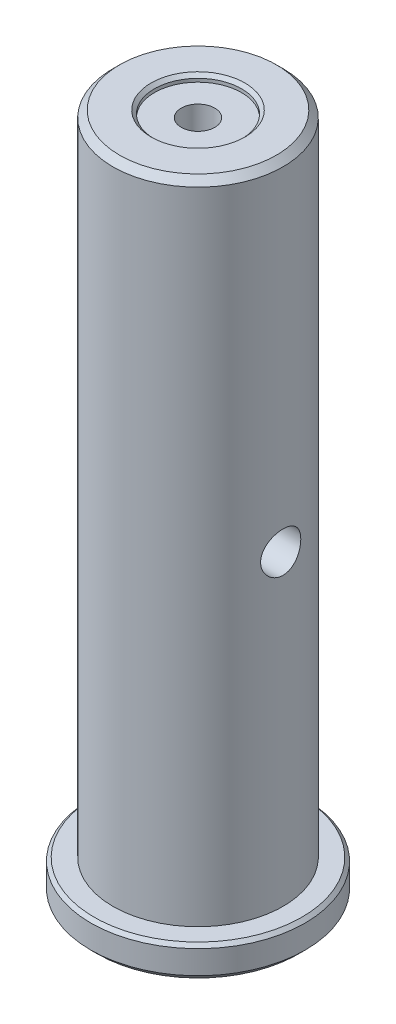
ISO-10303-21;
HEADER;
FILE_DESCRIPTION(('STEP AP214'),'2;1');
FILE_NAME('part.step','',(''),(''),'','','');
FILE_SCHEMA(('AUTOMOTIVE_DESIGN { 1 0 10303 214 1 1 1 1 }'));
ENDSEC;
DATA;
#1=APPLICATION_CONTEXT('core data for automotive mechanical design processes');
#2=APPLICATION_PROTOCOL_DEFINITION('international standard','automotive_design',2000,#1);
#3=PRODUCT_CONTEXT('',#1,'mechanical');
#4=PRODUCT('Part','Part','',(#3));
#5=PRODUCT_RELATED_PRODUCT_CATEGORY('part','',(#4));
#6=PRODUCT_DEFINITION_FORMATION('','',#4);
#7=PRODUCT_DEFINITION_CONTEXT('part definition',#1,'design');
#8=PRODUCT_DEFINITION('design','',#6,#7);
#9=PRODUCT_DEFINITION_SHAPE('','',#8);
#10=(LENGTH_UNIT() NAMED_UNIT(*) SI_UNIT(.MILLI.,.METRE.));
#11=(NAMED_UNIT(*) PLANE_ANGLE_UNIT() SI_UNIT($,.RADIAN.));
#12=(NAMED_UNIT(*) SI_UNIT($,.STERADIAN.) SOLID_ANGLE_UNIT());
#13=UNCERTAINTY_MEASURE_WITH_UNIT(LENGTH_MEASURE(1.E-05),#10,'distance_accuracy_value','');
#14=(GEOMETRIC_REPRESENTATION_CONTEXT(3) GLOBAL_UNCERTAINTY_ASSIGNED_CONTEXT((#13)) GLOBAL_UNIT_ASSIGNED_CONTEXT((#10,
#11,#12)) REPRESENTATION_CONTEXT('',''));
#15=CARTESIAN_POINT('',(0.,0.,0.));
#16=DIRECTION('',(0.,0.,1.));
#17=DIRECTION('',(1.,0.,0.));
#18=AXIS2_PLACEMENT_3D('',#15,#16,#17);
#19=CARTESIAN_POINT('',(0.,-26.0999999998717,0.));
#20=DIRECTION('',(0.,-1.,0.));
#21=DIRECTION('',(0.,0.,-1.));
#22=AXIS2_PLACEMENT_3D('',#19,#20,#21);
#23=CONICAL_SURFACE('',#22,2.49999999988404,1.02974425862171);
#24=CARTESIAN_POINT('',(0.,-24.5978484523448,5.6843418860808E-11));
#25=VERTEX_POINT('',#24);
#26=VERTEX_LOOP('',#25);
#27=FACE_BOUND('',#26,.T.);
#28=CARTESIAN_POINT('',(0.,-26.1,0.));
#29=DIRECTION('',(0.,-1.,0.));
#30=DIRECTION('',(0.,0.,-1.));
#31=AXIS2_PLACEMENT_3D('',#28,#29,#30);
#32=CIRCLE('',#31,2.5);
#33=CARTESIAN_POINT('',(0.,-26.1,-2.5));
#34=VERTEX_POINT('',#33);
#35=EDGE_CURVE('E70',#34,#34,#32,.T.);
#36=ORIENTED_EDGE('',*,*,#35,.T.);
#37=EDGE_LOOP('',(#36));
#38=FACE_BOUND('',#37,.T.);
#39=ADVANCED_FACE('F37',(#27,#38),#23,.F.);
#40=CARTESIAN_POINT('',(0.,-37.1,0.));
#41=DIRECTION('',(0.,-1.,0.));
#42=DIRECTION('',(0.,0.,-1.));
#43=AXIS2_PLACEMENT_3D('',#40,#41,#42);
#44=CYLINDRICAL_SURFACE('',#43,2.5);
#45=CARTESIAN_POINT('',(0.,-37.1,0.));
#46=DIRECTION('',(0.,-1.,0.));
#47=DIRECTION('',(0.,0.,-1.));
#48=AXIS2_PLACEMENT_3D('',#45,#46,#47);
#49=CIRCLE('',#48,2.5);
#50=CARTESIAN_POINT('',(0.,-37.1,-2.5));
#51=VERTEX_POINT('',#50);
#52=EDGE_CURVE('E96',#51,#51,#49,.T.);
#53=ORIENTED_EDGE('',*,*,#52,.T.);
#54=EDGE_LOOP('',(#53));
#55=FACE_BOUND('',#54,.T.);
#56=ORIENTED_EDGE('',*,*,#35,.F.);
#57=EDGE_LOOP('',(#56));
#58=FACE_BOUND('',#57,.T.);
#59=ADVANCED_FACE('F155',(#55,#58),#44,.F.);
#60=CARTESIAN_POINT('',(0.,-37.1,0.));
#61=DIRECTION('',(0.,1.,0.));
#62=DIRECTION('',(0.,0.,1.));
#63=AXIS2_PLACEMENT_3D('',#60,#61,#62);
#64=PLANE('',#63);
#65=CARTESIAN_POINT('',(0.,-37.1,0.));
#66=DIRECTION('',(0.,-1.,0.));
#67=DIRECTION('',(0.,0.,-1.));
#68=AXIS2_PLACEMENT_3D('',#65,#66,#67);
#69=CIRCLE('',#68,9.00000000000001);
#70=CARTESIAN_POINT('',(0.,-37.1,-9.00000000000001));
#71=VERTEX_POINT('',#70);
#72=EDGE_CURVE('E91',#71,#71,#69,.T.);
#73=ORIENTED_EDGE('',*,*,#72,.T.);
#74=EDGE_LOOP('',(#73));
#75=FACE_BOUND('',#74,.T.);
#76=ORIENTED_EDGE('',*,*,#52,.F.);
#77=EDGE_LOOP('',(#76));
#78=FACE_BOUND('',#77,.T.);
#79=ADVANCED_FACE('F162',(#75,#78),#64,.F.);
#80=CARTESIAN_POINT('',(0.,-37.6,0.));
#81=DIRECTION('',(0.,-1.,0.));
#82=DIRECTION('',(0.,0.,-1.));
#83=AXIS2_PLACEMENT_3D('',#80,#81,#82);
#84=CONICAL_SURFACE('',#83,9.50000000000001,0.78539816339745);
#85=ORIENTED_EDGE('',*,*,#72,.F.);
#86=EDGE_LOOP('',(#85));
#87=FACE_BOUND('',#86,.T.);
#88=CARTESIAN_POINT('',(0.,-37.6,0.));
#89=DIRECTION('',(0.,1.,0.));
#90=DIRECTION('',(0.,0.,1.));
#91=AXIS2_PLACEMENT_3D('',#88,#89,#90);
#92=CIRCLE('',#91,9.50000000000001);
#93=CARTESIAN_POINT('',(0.,-37.6,9.50000000000001));
#94=VERTEX_POINT('',#93);
#95=EDGE_CURVE('E87',#94,#94,#92,.F.);
#96=ORIENTED_EDGE('',*,*,#95,.T.);
#97=EDGE_LOOP('',(#96));
#98=FACE_BOUND('',#97,.T.);
#99=ADVANCED_FACE('F169',(#87,#98),#84,.F.);
#100=CARTESIAN_POINT('',(0.,26.5038387670979,0.));
#101=DIRECTION('',(0.,1.,0.));
#102=DIRECTION('',(0.,0.,1.));
#103=AXIS2_PLACEMENT_3D('',#100,#101,#102);
#104=CYLINDRICAL_SURFACE('',#103,9.50000000000001);
#105=ORIENTED_EDGE('',*,*,#95,.F.);
#106=EDGE_LOOP('',(#105));
#107=FACE_BOUND('',#106,.T.);
#108=CARTESIAN_POINT('',(0.,-38.1,0.));
#109=DIRECTION('',(0.,1.,0.));
#110=DIRECTION('',(0.,0.,1.));
#111=AXIS2_PLACEMENT_3D('',#108,#109,#110);
#112=CIRCLE('',#111,9.50000000000001);
#113=CARTESIAN_POINT('',(0.,-38.1,9.50000000000001));
#114=VERTEX_POINT('',#113);
#115=EDGE_CURVE('E90',#114,#114,#112,.F.);
#116=ORIENTED_EDGE('',*,*,#115,.T.);
#117=EDGE_LOOP('',(#116));
#118=FACE_BOUND('',#117,.T.);
#119=ADVANCED_FACE('F173',(#107,#118),#104,.F.);
#120=CARTESIAN_POINT('',(9.50000000000001,-38.1,0.));
#121=DIRECTION('',(0.,1.,0.));
#122=DIRECTION('',(0.,0.,1.));
#123=AXIS2_PLACEMENT_3D('',#120,#121,#122);
#124=PLANE('',#123);
#125=ORIENTED_EDGE('',*,*,#115,.F.);
#126=EDGE_LOOP('',(#125));
#127=FACE_BOUND('',#126,.T.);
#128=CARTESIAN_POINT('',(0.,-38.1,0.));
#129=DIRECTION('',(0.,1.,0.));
#130=DIRECTION('',(0.,0.,1.));
#131=AXIS2_PLACEMENT_3D('',#128,#129,#130);
#132=CIRCLE('',#131,15.);
#133=CARTESIAN_POINT('',(0.,-38.1,15.));
#134=VERTEX_POINT('',#133);
#135=EDGE_CURVE('E84',#134,#134,#132,.T.);
#136=ORIENTED_EDGE('',*,*,#135,.F.);
#137=EDGE_LOOP('',(#136));
#138=FACE_BOUND('',#137,.T.);
#139=ADVANCED_FACE('F176',(#127,#138),#124,.F.);
#140=CARTESIAN_POINT('',(0.,-37.1,0.));
#141=DIRECTION('',(0.,1.,0.));
#142=DIRECTION('',(0.,0.,1.));
#143=AXIS2_PLACEMENT_3D('',#140,#141,#142);
#144=CONICAL_SURFACE('',#143,16.,0.785398163397447);
#145=ORIENTED_EDGE('',*,*,#135,.T.);
#146=EDGE_LOOP('',(#145));
#147=FACE_BOUND('',#146,.T.);
#148=CARTESIAN_POINT('',(0.,-37.1,0.));
#149=DIRECTION('',(0.,1.,0.));
#150=DIRECTION('',(0.,0.,1.));
#151=AXIS2_PLACEMENT_3D('',#148,#149,#150);
#152=CIRCLE('',#151,16.);
#153=CARTESIAN_POINT('',(0.,-37.1,16.));
#154=VERTEX_POINT('',#153);
#155=EDGE_CURVE('E79',#154,#154,#152,.T.);
#156=ORIENTED_EDGE('',*,*,#155,.F.);
#157=EDGE_LOOP('',(#156));
#158=FACE_BOUND('',#157,.T.);
#159=ADVANCED_FACE('F180',(#147,#158),#144,.T.);
#160=CARTESIAN_POINT('',(0.,26.5038387670979,0.));
#161=DIRECTION('',(0.,1.,0.));
#162=DIRECTION('',(0.,0.,1.));
#163=AXIS2_PLACEMENT_3D('',#160,#161,#162);
#164=CYLINDRICAL_SURFACE('',#163,16.);
#165=ORIENTED_EDGE('',*,*,#155,.T.);
#166=EDGE_LOOP('',(#165));
#167=FACE_BOUND('',#166,.T.);
#168=CARTESIAN_POINT('',(0.,-33.6,0.));
#169=DIRECTION('',(0.,-1.,0.));
#170=DIRECTION('',(0.,0.,-1.));
#171=AXIS2_PLACEMENT_3D('',#168,#169,#170);
#172=CIRCLE('',#171,16.);
#173=CARTESIAN_POINT('',(0.,-33.6,-16.));
#174=VERTEX_POINT('',#173);
#175=EDGE_CURVE('E75',#174,#174,#172,.F.);
#176=ORIENTED_EDGE('',*,*,#175,.F.);
#177=EDGE_LOOP('',(#176));
#178=FACE_BOUND('',#177,.T.);
#179=ADVANCED_FACE('F184',(#167,#178),#164,.T.);
#180=CARTESIAN_POINT('',(0.,-33.6,0.));
#181=DIRECTION('',(0.,-1.,0.));
#182=DIRECTION('',(0.,0.,-1.));
#183=AXIS2_PLACEMENT_3D('',#180,#181,#182);
#184=CONICAL_SURFACE('',#183,16.,0.785398163397448);
#185=ORIENTED_EDGE('',*,*,#175,.T.);
#186=EDGE_LOOP('',(#185));
#187=FACE_BOUND('',#186,.T.);
#188=CARTESIAN_POINT('',(0.,-33.1,0.));
#189=DIRECTION('',(0.,-1.,0.));
#190=DIRECTION('',(0.,0.,-1.));
#191=AXIS2_PLACEMENT_3D('',#188,#189,#190);
#192=CIRCLE('',#191,15.5);
#193=CARTESIAN_POINT('',(0.,-33.1,-15.5));
#194=VERTEX_POINT('',#193);
#195=EDGE_CURVE('E78',#194,#194,#192,.T.);
#196=ORIENTED_EDGE('',*,*,#195,.T.);
#197=EDGE_LOOP('',(#196));
#198=FACE_BOUND('',#197,.T.);
#199=ADVANCED_FACE('F188',(#187,#198),#184,.T.);
#200=CARTESIAN_POINT('',(15.5,-33.1,0.));
#201=DIRECTION('',(0.,-1.,0.));
#202=DIRECTION('',(0.,0.,-1.));
#203=AXIS2_PLACEMENT_3D('',#200,#201,#202);
#204=PLANE('',#203);
#205=ORIENTED_EDGE('',*,*,#195,.F.);
#206=EDGE_LOOP('',(#205));
#207=FACE_BOUND('',#206,.T.);
#208=CARTESIAN_POINT('',(0.,-33.1,0.));
#209=DIRECTION('',(0.,1.,0.));
#210=DIRECTION('',(0.,0.,1.));
#211=AXIS2_PLACEMENT_3D('',#208,#209,#210);
#212=CIRCLE('',#211,12.7);
#213=CARTESIAN_POINT('',(0.,-33.1,12.7));
#214=VERTEX_POINT('',#213);
#215=EDGE_CURVE('E99',#214,#214,#212,.T.);
#216=ORIENTED_EDGE('',*,*,#215,.F.);
#217=EDGE_LOOP('',(#216));
#218=FACE_BOUND('',#217,.T.);
#219=ADVANCED_FACE('F151',(#207,#218),#204,.F.);
#220=CARTESIAN_POINT('',(0.,26.5038387670979,0.));
#221=DIRECTION('',(0.,1.,0.));
#222=DIRECTION('',(0.,0.,1.));
#223=AXIS2_PLACEMENT_3D('',#220,#221,#222);
#224=CYLINDRICAL_SURFACE('',#223,12.7);
#225=CARTESIAN_POINT('',(-12.3405834546021,12.7,-3.));
#226=CARTESIAN_POINT('',(-12.3405867552515,12.5340309742241,-2.9999947986192));
#227=CARTESIAN_POINT('',(-12.3439681639376,12.3680022234936,-2.98618025270878));
#228=CARTESIAN_POINT('',(-12.3570983771738,12.0406913937602,-2.93136245477037));
#229=CARTESIAN_POINT('',(-12.3668512939366,11.8794124506168,-2.89034164338149));
#230=CARTESIAN_POINT('',(-12.3915597141969,11.5663829455557,-2.78249577795815));
#231=CARTESIAN_POINT('',(-12.406508961645,11.4146211837446,-2.71570174263797));
#232=CARTESIAN_POINT('',(-12.439917980932,11.1244468335215,-2.5582975169812));
#233=CARTESIAN_POINT('',(-12.4583778022552,10.9860344333204,-2.46768699092613));
#234=CARTESIAN_POINT('',(-12.4971341157553,10.7237648667291,-2.26332000863186));
#235=CARTESIAN_POINT('',(-12.5174573393053,10.6002087828986,-2.14918216282701));
#236=CARTESIAN_POINT('',(-12.5574177003081,10.3738045192715,-1.90182286693526));
#237=CARTESIAN_POINT('',(-12.5770547786081,10.2709581212415,-1.76859977652744));
#238=CARTESIAN_POINT('',(-12.6137239719163,10.0876793742958,-1.48480893314834));
#239=CARTESIAN_POINT('',(-12.6307208615053,10.0075400019444,-1.33404702472816));
#240=CARTESIAN_POINT('',(-12.6598909936041,9.87385075363945,-1.02072515323631));
#241=CARTESIAN_POINT('',(-12.6720648694535,9.82029738628045,-0.858166742555063));
#242=CARTESIAN_POINT('',(-12.6900283681532,9.74225680782282,-0.529001629765291));
#243=CARTESIAN_POINT('',(-12.6959299939122,9.71725905294493,-0.362522187479541));
#244=CARTESIAN_POINT('',(-12.7010733204737,9.69543960599661,-0.0276350287817146));
#245=CARTESIAN_POINT('',(-12.7003159043761,9.69861417780695,0.140772428985137));
#246=CARTESIAN_POINT('',(-12.6923108785029,9.73267611495724,0.47120402884937));
#247=CARTESIAN_POINT('',(-12.685192248261,9.76301276772744,0.633288530270402));
#248=CARTESIAN_POINT('',(-12.6654133212508,9.84965600478243,0.949998324283788));
#249=CARTESIAN_POINT('',(-12.652752748352,9.90596388310576,1.10462324477204));
#250=CARTESIAN_POINT('',(-12.6231105369077,10.0434155280563,1.40351094180074));
#251=CARTESIAN_POINT('',(-12.6060939900068,10.1247610633708,1.54767732548809));
#252=CARTESIAN_POINT('',(-12.569594968861,10.3098271166194,1.82050994076874));
#253=CARTESIAN_POINT('',(-12.5501121075764,10.4135511482231,1.94917373333533));
#254=CARTESIAN_POINT('',(-12.5102557426675,10.6434035197155,2.19062975846301));
#255=CARTESIAN_POINT('',(-12.4898720962147,10.770013554354,2.30296222384418));
#256=CARTESIAN_POINT('',(-12.4509479008397,11.0404875791052,2.50489570740951));
#257=CARTESIAN_POINT('',(-12.4324074202314,11.1843522082947,2.59449588325037));
#258=CARTESIAN_POINT('',(-12.3992364452359,11.4860805887778,2.74867389435205));
#259=CARTESIAN_POINT('',(-12.3846216061614,11.6439971432482,2.81315199075165));
#260=CARTESIAN_POINT('',(-12.361163891032,11.9688543435126,2.91450898004239));
#261=CARTESIAN_POINT('',(-12.3523199281954,12.1357932837791,2.95139306967752));
#262=CARTESIAN_POINT('',(-12.3416305703028,12.4697211574721,2.99577506689082));
#263=CARTESIAN_POINT('',(-12.3396244346744,12.6366153291514,3.0039480461921));
#264=CARTESIAN_POINT('',(-12.3424021208832,12.9693819763325,2.99251467034554));
#265=CARTESIAN_POINT('',(-12.3471853912633,13.1352545337141,2.97291057134052));
#266=CARTESIAN_POINT('',(-12.3628499077692,13.4588346439623,2.90706871465485));
#267=CARTESIAN_POINT('',(-12.37364334047,13.6166248358406,2.86121423179317));
#268=CARTESIAN_POINT('',(-12.4000305578142,13.9222810505835,2.74459361459815));
#269=CARTESIAN_POINT('',(-12.4156248628205,14.0701459955406,2.67382477969692));
#270=CARTESIAN_POINT('',(-12.4502018670966,14.3546426079838,2.5079376913544));
#271=CARTESIAN_POINT('',(-12.4692397057665,14.4910288293784,2.41241023649747));
#272=CARTESIAN_POINT('',(-12.508418891342,14.7460832351942,2.20024312204814));
#273=CARTESIAN_POINT('',(-12.5285603989996,14.8647488291373,2.08360038123467));
#274=CARTESIAN_POINT('',(-12.5682154806913,15.0836757565837,1.8294351289871));
#275=CARTESIAN_POINT('',(-12.5877053868826,15.1834731277362,1.69150862917181));
#276=CARTESIAN_POINT('',(-12.6233979717533,15.3584849186101,1.40045958706062));
#277=CARTESIAN_POINT('',(-12.6396008155023,15.4337005728922,1.24733780841667));
#278=CARTESIAN_POINT('',(-12.6667953232137,15.5567989973915,0.93126634009259));
#279=CARTESIAN_POINT('',(-12.6778226529874,15.6048693146483,0.768392904306751));
#280=CARTESIAN_POINT('',(-12.6935789726756,15.672887097615,0.436588241550904));
#281=CARTESIAN_POINT('',(-12.6983090399519,15.6928393739101,0.267658055874666));
#282=CARTESIAN_POINT('',(-12.7008993537832,15.7038086341681,-0.0670858950952592));
#283=CARTESIAN_POINT('',(-12.698922999739,15.6955138298096,-0.232876206526177));
#284=CARTESIAN_POINT('',(-12.6886792846242,15.6517838547065,-0.560628835557877));
#285=CARTESIAN_POINT('',(-12.6804120752351,15.6163493383389,-0.722591245357748));
#286=CARTESIAN_POINT('',(-12.6585349476798,15.519697769664,-1.03745535327696));
#287=CARTESIAN_POINT('',(-12.6449483253229,15.458593053244,-1.19039325739077));
#288=CARTESIAN_POINT('',(-12.6138718519278,15.3124400630194,-1.48392969727621));
#289=CARTESIAN_POINT('',(-12.5963815576374,15.227389069888,-1.62452682925616));
#290=CARTESIAN_POINT('',(-12.5589188788385,15.0335926487413,-1.89269784116764));
#291=CARTESIAN_POINT('',(-12.538900801949,14.924372322815,-2.01992216623951));
#292=CARTESIAN_POINT('',(-12.498861896439,14.6862761933158,-2.2544712498921));
#293=CARTESIAN_POINT('',(-12.4788410683609,14.557395538937,-2.36179108290443));
#294=CARTESIAN_POINT('',(-12.4406982518011,14.2811279693928,-2.55517580989631));
#295=CARTESIAN_POINT('',(-12.4226122154044,14.1334754329365,-2.64086882423842));
#296=CARTESIAN_POINT('',(-12.3908548561017,13.8254595481595,-2.78608721227337));
#297=CARTESIAN_POINT('',(-12.377180079871,13.6651062656254,-2.84563306834565));
#298=CARTESIAN_POINT('',(-12.3581116997091,13.3706830677178,-2.92718665623946));
#299=CARTESIAN_POINT('',(-12.3515853338036,13.2381136225664,-2.95443550510605));
#300=CARTESIAN_POINT('',(-12.3428200100531,12.9703758812207,-2.99084369124858));
#301=CARTESIAN_POINT('',(-12.3405807657064,12.8352077593017,-3.00000423733911));
#302=CARTESIAN_POINT('',(-12.3405834546021,12.7,-3.));
#303=B_SPLINE_CURVE_WITH_KNOTS('',3,(#225,#226,#227,#228,#229,#230,#231,#232,#233,#234,#235,
#236,#237,#238,#239,#240,#241,#242,#243,#244,#245,#246,#247,#248,#249,#250,#251,#252,#253,#254,
#255,#256,#257,#258,#259,#260,#261,#262,#263,#264,#265,#266,#267,#268,#269,#270,#271,#272,#273,
#274,#275,#276,#277,#278,#279,#280,#281,#282,#283,#284,#285,#286,#287,#288,#289,#290,#291,#292,
#293,#294,#295,#296,#297,#298,#299,#300,#301,#302),.UNSPECIFIED.,.T.,.F.,(4,2,2,2,2,2,2,2,2,2,2,
2,2,2,2,2,2,2,2,2,2,2,2,2,2,2,2,2,2,2,2,2,2,2,2,2,2,2,4),(0.,0.497411026443944,
0.995143402777372,1.49227860492331,1.98942081508859,2.49536478555058,3.00135226653359,
3.51359835731242,4.02577715959639,4.52864792978655,5.03145201194261,5.52428694235286,
6.01714643133854,6.51408654761748,7.01110474580709,7.52015808792639,8.02923029022512,
8.54030348656796,9.05128040890335,9.5501594423104,10.048997957495,10.5407323472655,
11.0325200545446,11.5330211371553,12.0335953137055,12.5452167410731,13.0568124694697,
13.5648289273917,14.0727584605778,14.568402228839,15.0640340468005,15.5575191492549,
16.0510603142398,16.555330529637,17.0597253658004,17.5722788464447,18.0844300988553,
18.4896763485681,18.8948955153554),.UNSPECIFIED.);
#304=CARTESIAN_POINT('',(-12.3405834546021,12.7,-3.));
#305=VERTEX_POINT('',#304);
#306=EDGE_CURVE('E41',#305,#305,#303,.T.);
#307=ORIENTED_EDGE('',*,*,#306,.F.);
#308=EDGE_LOOP('',(#307));
#309=FACE_BOUND('',#308,.T.);
#310=CARTESIAN_POINT('',(12.3405834546021,12.7,-3.));
#311=CARTESIAN_POINT('',(12.3405867552515,12.8659690257759,-2.9999947986192));
#312=CARTESIAN_POINT('',(12.3439681639376,13.0319977765064,-2.98618025270878));
#313=CARTESIAN_POINT('',(12.3570983771738,13.3593086062398,-2.93136245477037));
#314=CARTESIAN_POINT('',(12.3668512939366,13.5205875493833,-2.89034164338149));
#315=CARTESIAN_POINT('',(12.3915597141969,13.8336170544443,-2.78249577795815));
#316=CARTESIAN_POINT('',(12.406508961645,13.9853788162555,-2.71570174263797));
#317=CARTESIAN_POINT('',(12.439917980932,14.2755531664785,-2.5582975169812));
#318=CARTESIAN_POINT('',(12.4583778022552,14.4139655666796,-2.46768699092613));
#319=CARTESIAN_POINT('',(12.4971341157553,14.6762351332709,-2.26332000863186));
#320=CARTESIAN_POINT('',(12.5174573393053,14.7997912171014,-2.14918216282701));
#321=CARTESIAN_POINT('',(12.5574177003081,15.0261954807285,-1.90182286693525));
#322=CARTESIAN_POINT('',(12.5770547786081,15.1290418787585,-1.76859977652744));
#323=CARTESIAN_POINT('',(12.6137239719163,15.3123206257042,-1.48480893314834));
#324=CARTESIAN_POINT('',(12.6307208615053,15.3924599980556,-1.33404702472816));
#325=CARTESIAN_POINT('',(12.6598909936041,15.5261492463606,-1.02072515323631));
#326=CARTESIAN_POINT('',(12.6720648694535,15.5797026137196,-0.858166742555063));
#327=CARTESIAN_POINT('',(12.6900283681532,15.6577431921772,-0.529001629765292));
#328=CARTESIAN_POINT('',(12.6959299939122,15.6827409470551,-0.362522187479542));
#329=CARTESIAN_POINT('',(12.7010733204737,15.7045603940034,-0.0276350287817158));
#330=CARTESIAN_POINT('',(12.7003159043761,15.7013858221931,0.140772428985136));
#331=CARTESIAN_POINT('',(12.6923108785029,15.6673238850428,0.471204028849369));
#332=CARTESIAN_POINT('',(12.685192248261,15.6369872322726,0.633288530270401));
#333=CARTESIAN_POINT('',(12.6654133212508,15.5503439952176,0.949998324283788));
#334=CARTESIAN_POINT('',(12.652752748352,15.4940361168942,1.10462324477204));
#335=CARTESIAN_POINT('',(12.6231105369077,15.3565844719437,1.40351094180074));
#336=CARTESIAN_POINT('',(12.6060939900068,15.2752389366292,1.54767732548809));
#337=CARTESIAN_POINT('',(12.569594968861,15.0901728833806,1.82050994076874));
#338=CARTESIAN_POINT('',(12.5501121075764,14.9864488517769,1.94917373333533));
#339=CARTESIAN_POINT('',(12.5102557426675,14.7565964802845,2.19062975846301));
#340=CARTESIAN_POINT('',(12.4898720962147,14.629986445646,2.30296222384418));
#341=CARTESIAN_POINT('',(12.4509479008397,14.3595124208948,2.50489570740951));
#342=CARTESIAN_POINT('',(12.4324074202314,14.2156477917053,2.59449588325037));
#343=CARTESIAN_POINT('',(12.3992364452359,13.9139194112222,2.74867389435205));
#344=CARTESIAN_POINT('',(12.3846216061614,13.7560028567518,2.81315199075165));
#345=CARTESIAN_POINT('',(12.361163891032,13.4311456564874,2.91450898004239));
#346=CARTESIAN_POINT('',(12.3523199281954,13.2642067162209,2.95139306967752));
#347=CARTESIAN_POINT('',(12.3416305703028,12.9302788425279,2.99577506689082));
#348=CARTESIAN_POINT('',(12.3396244346744,12.7633846708486,3.0039480461921));
#349=CARTESIAN_POINT('',(12.3424021208832,12.4306180236675,2.99251467034554));
#350=CARTESIAN_POINT('',(12.3471853912633,12.2647454662859,2.97291057134052));
#351=CARTESIAN_POINT('',(12.3628499077692,11.9411653560378,2.90706871465485));
#352=CARTESIAN_POINT('',(12.37364334047,11.7833751641594,2.86121423179317));
#353=CARTESIAN_POINT('',(12.4000305578142,11.4777189494165,2.74459361459815));
#354=CARTESIAN_POINT('',(12.4156248628205,11.3298540044594,2.67382477969692));
#355=CARTESIAN_POINT('',(12.4502018670965,11.0453573920162,2.5079376913544));
#356=CARTESIAN_POINT('',(12.4692397057665,10.9089711706216,2.41241023649747));
#357=CARTESIAN_POINT('',(12.508418891342,10.6539167648058,2.20024312204814));
#358=CARTESIAN_POINT('',(12.5285603989996,10.5352511708627,2.08360038123467));
#359=CARTESIAN_POINT('',(12.5682154806913,10.3163242434163,1.8294351289871));
#360=CARTESIAN_POINT('',(12.5877053868826,10.2165268722638,1.69150862917181));
#361=CARTESIAN_POINT('',(12.6233979717533,10.0415150813899,1.40045958706062));
#362=CARTESIAN_POINT('',(12.6396008155023,9.96629942710778,1.24733780841667));
#363=CARTESIAN_POINT('',(12.6667953232137,9.84320100260848,0.93126634009259));
#364=CARTESIAN_POINT('',(12.6778226529874,9.79513068535167,0.768392904306751));
#365=CARTESIAN_POINT('',(12.6935789726756,9.72711290238502,0.436588241550904));
#366=CARTESIAN_POINT('',(12.6983090399519,9.70716062608995,0.267658055874666));
#367=CARTESIAN_POINT('',(12.7008993537832,9.69619136583193,-0.0670858950952596));
#368=CARTESIAN_POINT('',(12.698922999739,9.70448617019036,-0.232876206526178));
#369=CARTESIAN_POINT('',(12.6886792846242,9.74821614529348,-0.560628835557878));
#370=CARTESIAN_POINT('',(12.6804120752351,9.78365066166113,-0.722591245357749));
#371=CARTESIAN_POINT('',(12.6585349476798,9.88030223033604,-1.03745535327696));
#372=CARTESIAN_POINT('',(12.6449483253229,9.94140694675598,-1.19039325739077));
#373=CARTESIAN_POINT('',(12.6138718519278,10.0875599369806,-1.48392969727621));
#374=CARTESIAN_POINT('',(12.5963815576374,10.172610930112,-1.62452682925616));
#375=CARTESIAN_POINT('',(12.5589188788385,10.3664073512587,-1.89269784116764));
#376=CARTESIAN_POINT('',(12.538900801949,10.475627677185,-2.01992216623951));
#377=CARTESIAN_POINT('',(12.498861896439,10.7137238066842,-2.2544712498921));
#378=CARTESIAN_POINT('',(12.4788410683609,10.842604461063,-2.36179108290443));
#379=CARTESIAN_POINT('',(12.4406982518011,11.1188720306072,-2.55517580989631));
#380=CARTESIAN_POINT('',(12.4226122154044,11.2665245670635,-2.64086882423842));
#381=CARTESIAN_POINT('',(12.3908548561017,11.5745404518405,-2.78608721227337));
#382=CARTESIAN_POINT('',(12.377180079871,11.7348937343746,-2.84563306834565));
#383=CARTESIAN_POINT('',(12.3581116997091,12.0293169322822,-2.92718665623946));
#384=CARTESIAN_POINT('',(12.3515853338036,12.1618863774336,-2.95443550510605));
#385=CARTESIAN_POINT('',(12.3428200100531,12.4296241187794,-2.99084369124858));
#386=CARTESIAN_POINT('',(12.3405807657064,12.5647922406983,-3.00000423733911));
#387=CARTESIAN_POINT('',(12.3405834546021,12.7,-3.));
#388=B_SPLINE_CURVE_WITH_KNOTS('',3,(#310,#311,#312,#313,#314,#315,#316,#317,#318,#319,#320,
#321,#322,#323,#324,#325,#326,#327,#328,#329,#330,#331,#332,#333,#334,#335,#336,#337,#338,#339,
#340,#341,#342,#343,#344,#345,#346,#347,#348,#349,#350,#351,#352,#353,#354,#355,#356,#357,#358,
#359,#360,#361,#362,#363,#364,#365,#366,#367,#368,#369,#370,#371,#372,#373,#374,#375,#376,#377,
#378,#379,#380,#381,#382,#383,#384,#385,#386,#387),.UNSPECIFIED.,.T.,.F.,(4,2,2,2,2,2,2,2,2,2,2,
2,2,2,2,2,2,2,2,2,2,2,2,2,2,2,2,2,2,2,2,2,2,2,2,2,2,2,4),(0.,0.497411026443946,
0.995143402777372,1.49227860492331,1.98942081508859,2.49536478555058,3.00135226653359,
3.51359835731242,4.02577715959639,4.52864792978654,5.03145201194261,5.52428694235286,
6.01714643133854,6.51408654761748,7.01110474580709,7.52015808792639,8.02923029022512,
8.54030348656796,9.05128040890335,9.5501594423104,10.0489979574951,10.5407323472655,
11.0325200545446,11.5330211371553,12.0335953137055,12.5452167410731,13.0568124694697,
13.5648289273917,14.0727584605778,14.568402228839,15.0640340468005,15.5575191492549,
16.0510603142398,16.555330529637,17.0597253658004,17.5722788464447,18.0844300988553,
18.4896763485681,18.8948955153554),.UNSPECIFIED.);
#389=CARTESIAN_POINT('',(12.3405834546021,12.7,-3.));
#390=VERTEX_POINT('',#389);
#391=EDGE_CURVE('E119',#390,#390,#388,.T.);
#392=ORIENTED_EDGE('',*,*,#391,.F.);
#393=EDGE_LOOP('',(#392));
#394=FACE_BOUND('',#393,.T.);
#395=CARTESIAN_POINT('',(0.,62.5,0.));
#396=DIRECTION('',(0.,1.,0.));
#397=DIRECTION('',(0.,0.,1.));
#398=AXIS2_PLACEMENT_3D('',#395,#396,#397);
#399=CIRCLE('',#398,12.7);
#400=CARTESIAN_POINT('',(0.,62.5,12.7));
#401=VERTEX_POINT('',#400);
#402=EDGE_CURVE('E115',#401,#401,#399,.F.);
#403=ORIENTED_EDGE('',*,*,#402,.T.);
#404=EDGE_LOOP('',(#403));
#405=FACE_BOUND('',#404,.T.);
#406=ORIENTED_EDGE('',*,*,#215,.T.);
#407=EDGE_LOOP('',(#406));
#408=FACE_BOUND('',#407,.T.);
#409=ADVANCED_FACE('F123',(#309,#394,#405,#408),#224,.T.);
#410=CARTESIAN_POINT('',(0.,63.5,0.));
#411=DIRECTION('',(0.,1.,0.));
#412=DIRECTION('',(0.,0.,1.));
#413=AXIS2_PLACEMENT_3D('',#410,#411,#412);
#414=PLANE('',#413);
#415=CARTESIAN_POINT('',(0.,63.5,0.));
#416=DIRECTION('',(0.,1.,0.));
#417=DIRECTION('',(0.,0.,1.));
#418=AXIS2_PLACEMENT_3D('',#415,#416,#417);
#419=CIRCLE('',#418,6.99999999999999);
#420=CARTESIAN_POINT('',(0.,63.5,6.99999999999999));
#421=VERTEX_POINT('',#420);
#422=EDGE_CURVE('E11',#421,#421,#419,.F.);
#423=ORIENTED_EDGE('',*,*,#422,.T.);
#424=EDGE_LOOP('',(#423));
#425=FACE_BOUND('',#424,.T.);
#426=CARTESIAN_POINT('',(0.,63.5,0.));
#427=DIRECTION('',(0.,1.,0.));
#428=DIRECTION('',(0.,0.,1.));
#429=AXIS2_PLACEMENT_3D('',#426,#427,#428);
#430=CIRCLE('',#429,11.7);
#431=CARTESIAN_POINT('',(0.,63.5,11.7));
#432=VERTEX_POINT('',#431);
#433=EDGE_CURVE('E102',#432,#432,#430,.T.);
#434=ORIENTED_EDGE('',*,*,#433,.T.);
#435=EDGE_LOOP('',(#434));
#436=FACE_BOUND('',#435,.T.);
#437=ADVANCED_FACE('F143',(#425,#436),#414,.T.);
#438=CARTESIAN_POINT('',(0.,63.5,0.));
#439=DIRECTION('',(0.,-1.,0.));
#440=DIRECTION('',(0.,0.,-1.));
#441=AXIS2_PLACEMENT_3D('',#438,#439,#440);
#442=CONICAL_SURFACE('',#441,11.7,0.785398163397444);
#443=ORIENTED_EDGE('',*,*,#402,.F.);
#444=EDGE_LOOP('',(#443));
#445=FACE_BOUND('',#444,.T.);
#446=ORIENTED_EDGE('',*,*,#433,.F.);
#447=EDGE_LOOP('',(#446));
#448=FACE_BOUND('',#447,.T.);
#449=ADVANCED_FACE('F141',(#445,#448),#442,.T.);
#450=CARTESIAN_POINT('',(0.,62.5,0.));
#451=DIRECTION('',(0.,1.,0.));
#452=DIRECTION('',(0.,0.,1.));
#453=AXIS2_PLACEMENT_3D('',#450,#451,#452);
#454=CYLINDRICAL_SURFACE('',#453,6.5);
#455=CARTESIAN_POINT('',(0.,63.,0.));
#456=DIRECTION('',(0.,1.,0.));
#457=DIRECTION('',(0.,0.,1.));
#458=AXIS2_PLACEMENT_3D('',#455,#456,#457);
#459=CIRCLE('',#458,6.5);
#460=CARTESIAN_POINT('',(0.,63.,6.5));
#461=VERTEX_POINT('',#460);
#462=EDGE_CURVE('E50',#461,#461,#459,.T.);
#463=ORIENTED_EDGE('',*,*,#462,.T.);
#464=EDGE_LOOP('',(#463));
#465=FACE_BOUND('',#464,.T.);
#466=CARTESIAN_POINT('',(0.,62.5,0.));
#467=DIRECTION('',(0.,1.,0.));
#468=DIRECTION('',(0.,0.,1.));
#469=AXIS2_PLACEMENT_3D('',#466,#467,#468);
#470=CIRCLE('',#469,6.5);
#471=CARTESIAN_POINT('',(0.,62.5,6.5));
#472=VERTEX_POINT('',#471);
#473=EDGE_CURVE('E66',#472,#472,#470,.T.);
#474=ORIENTED_EDGE('',*,*,#473,.F.);
#475=EDGE_LOOP('',(#474));
#476=FACE_BOUND('',#475,.T.);
#477=ADVANCED_FACE('F138',(#465,#476),#454,.F.);
#478=CARTESIAN_POINT('',(0.,62.5,0.));
#479=DIRECTION('',(0.,1.,0.));
#480=DIRECTION('',(0.,0.,1.));
#481=AXIS2_PLACEMENT_3D('',#478,#479,#480);
#482=PLANE('',#481);
#483=CARTESIAN_POINT('',(0.,62.5,0.));
#484=DIRECTION('',(0.,1.,0.));
#485=DIRECTION('',(0.,0.,1.));
#486=AXIS2_PLACEMENT_3D('',#483,#484,#485);
#487=CIRCLE('',#486,2.5);
#488=CARTESIAN_POINT('',(0.,62.5,2.5));
#489=VERTEX_POINT('',#488);
#490=EDGE_CURVE('E67',#489,#489,#487,.T.);
#491=ORIENTED_EDGE('',*,*,#490,.F.);
#492=EDGE_LOOP('',(#491));
#493=FACE_BOUND('',#492,.T.);
#494=ORIENTED_EDGE('',*,*,#473,.T.);
#495=EDGE_LOOP('',(#494));
#496=FACE_BOUND('',#495,.T.);
#497=ADVANCED_FACE('F135',(#493,#496),#482,.T.);
#498=CARTESIAN_POINT('',(0.,63.,0.));
#499=DIRECTION('',(0.,1.,0.));
#500=DIRECTION('',(0.,0.,1.));
#501=AXIS2_PLACEMENT_3D('',#498,#499,#500);
#502=CONICAL_SURFACE('',#501,6.5,0.785398163397426);
#503=ORIENTED_EDGE('',*,*,#422,.F.);
#504=EDGE_LOOP('',(#503));
#505=FACE_BOUND('',#504,.T.);
#506=ORIENTED_EDGE('',*,*,#462,.F.);
#507=EDGE_LOOP('',(#506));
#508=FACE_BOUND('',#507,.T.);
#509=ADVANCED_FACE('F39',(#505,#508),#502,.F.);
#510=CARTESIAN_POINT('',(0.,51.5,0.));
#511=DIRECTION('',(0.,1.,0.));
#512=DIRECTION('',(0.,0.,1.));
#513=AXIS2_PLACEMENT_3D('',#510,#511,#512);
#514=CONICAL_SURFACE('',#513,2.5,1.02974425867665);
#515=CARTESIAN_POINT('',(0.,49.9978484524311,0.));
#516=VERTEX_POINT('',#515);
#517=VERTEX_LOOP('',#516);
#518=FACE_BOUND('',#517,.T.);
#519=CARTESIAN_POINT('',(0.,51.5,0.));
#520=DIRECTION('',(0.,1.,0.));
#521=DIRECTION('',(0.,0.,1.));
#522=AXIS2_PLACEMENT_3D('',#519,#520,#521);
#523=CIRCLE('',#522,2.5);
#524=CARTESIAN_POINT('',(0.,51.5,2.5));
#525=VERTEX_POINT('',#524);
#526=EDGE_CURVE('E64',#525,#525,#523,.T.);
#527=ORIENTED_EDGE('',*,*,#526,.T.);
#528=EDGE_LOOP('',(#527));
#529=FACE_BOUND('',#528,.T.);
#530=ADVANCED_FACE('F57',(#518,#529),#514,.F.);
#531=CARTESIAN_POINT('',(0.,62.5,0.));
#532=DIRECTION('',(0.,1.,0.));
#533=DIRECTION('',(0.,0.,1.));
#534=AXIS2_PLACEMENT_3D('',#531,#532,#533);
#535=CYLINDRICAL_SURFACE('',#534,2.5);
#536=ORIENTED_EDGE('',*,*,#526,.F.);
#537=EDGE_LOOP('',(#536));
#538=FACE_BOUND('',#537,.T.);
#539=ORIENTED_EDGE('',*,*,#490,.T.);
#540=EDGE_LOOP('',(#539));
#541=FACE_BOUND('',#540,.T.);
#542=ADVANCED_FACE('F60',(#538,#541),#535,.F.);
#543=CARTESIAN_POINT('',(-15.,12.7,0.));
#544=DIRECTION('',(1.,0.,0.));
#545=DIRECTION('',(0.,0.,-1.));
#546=AXIS2_PLACEMENT_3D('',#543,#544,#545);
#547=CYLINDRICAL_SURFACE('',#546,3.);
#548=ORIENTED_EDGE('',*,*,#306,.T.);
#549=EDGE_LOOP('',(#548));
#550=FACE_BOUND('',#549,.T.);
#551=ORIENTED_EDGE('',*,*,#391,.T.);
#552=EDGE_LOOP('',(#551));
#553=FACE_BOUND('',#552,.T.);
#554=ADVANCED_FACE('F127',(#550,#553),#547,.F.);
#555=CLOSED_SHELL('',(#39,#59,#79,#99,#119,#139,#159,#179,#199,#219,#409,#437,#449,#477,#497,
#509,#530,#542,#554));
#556=MANIFOLD_SOLID_BREP('B2',#555);
#557=ADVANCED_BREP_SHAPE_REPRESENTATION('',(#18,#556),#14);
#558=SHAPE_DEFINITION_REPRESENTATION(#9,#557);
ENDSEC;
END-ISO-10303-21;
